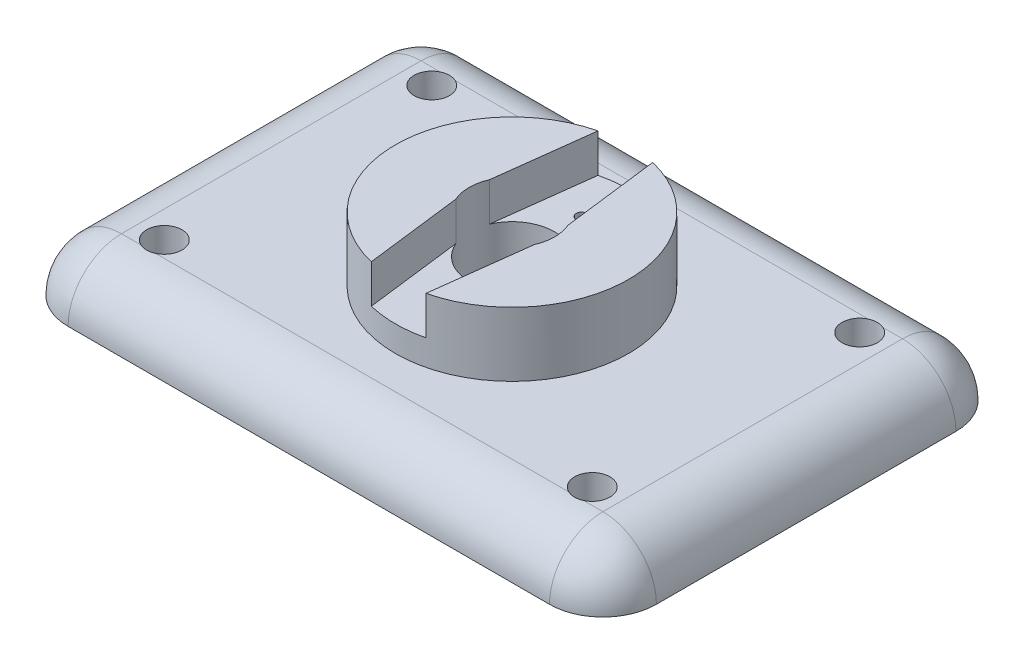
ISO-10303-21;
HEADER;
FILE_DESCRIPTION(('STEP AP214'),'2;1');
FILE_NAME('part.step','',(''),(''),'','','');
FILE_SCHEMA(('AUTOMOTIVE_DESIGN { 1 0 10303 214 1 1 1 1 }'));
ENDSEC;
DATA;
#1=APPLICATION_CONTEXT('core data for automotive mechanical design processes');
#2=APPLICATION_PROTOCOL_DEFINITION('international standard','automotive_design',2000,#1);
#3=PRODUCT_CONTEXT('',#1,'mechanical');
#4=PRODUCT('Part','Part','',(#3));
#5=PRODUCT_RELATED_PRODUCT_CATEGORY('part','',(#4));
#6=PRODUCT_DEFINITION_FORMATION('','',#4);
#7=PRODUCT_DEFINITION_CONTEXT('part definition',#1,'design');
#8=PRODUCT_DEFINITION('design','',#6,#7);
#9=PRODUCT_DEFINITION_SHAPE('','',#8);
#10=(LENGTH_UNIT() NAMED_UNIT(*) SI_UNIT(.MILLI.,.METRE.));
#11=(NAMED_UNIT(*) PLANE_ANGLE_UNIT() SI_UNIT($,.RADIAN.));
#12=(NAMED_UNIT(*) SI_UNIT($,.STERADIAN.) SOLID_ANGLE_UNIT());
#13=UNCERTAINTY_MEASURE_WITH_UNIT(LENGTH_MEASURE(1.E-05),#10,'distance_accuracy_value','');
#14=(GEOMETRIC_REPRESENTATION_CONTEXT(3) GLOBAL_UNCERTAINTY_ASSIGNED_CONTEXT((#13)) GLOBAL_UNIT_ASSIGNED_CONTEXT((#10,
#11,#12)) REPRESENTATION_CONTEXT('',''));
#15=CARTESIAN_POINT('',(0.,0.,0.));
#16=DIRECTION('',(0.,0.,1.));
#17=DIRECTION('',(1.,0.,0.));
#18=AXIS2_PLACEMENT_3D('',#15,#16,#17);
#19=CARTESIAN_POINT('',(22.5,0.,0.));
#20=DIRECTION('',(0.,0.,1.));
#21=DIRECTION('',(1.,0.,0.));
#22=AXIS2_PLACEMENT_3D('',#19,#20,#21);
#23=CYLINDRICAL_SURFACE('',#22,5.);
#24=CARTESIAN_POINT('',(22.5,0.,-14.));
#25=DIRECTION('',(0.,0.,-1.));
#26=DIRECTION('',(-1.,0.,0.));
#27=AXIS2_PLACEMENT_3D('',#24,#25,#26);
#28=CIRCLE('',#27,5.);
#29=CARTESIAN_POINT('',(22.5,5.,-14.));
#30=VERTEX_POINT('',#29);
#31=CARTESIAN_POINT('',(27.5,0.,-14.));
#32=VERTEX_POINT('',#31);
#33=EDGE_CURVE('E11',#30,#32,#28,.T.);
#34=ORIENTED_EDGE('',*,*,#33,.F.);
#35=DIRECTION('',(0.,0.,-1.));
#36=VECTOR('',#35,1.);
#37=CARTESIAN_POINT('',(22.5,5.,0.));
#38=LINE('',#37,#36);
#39=CARTESIAN_POINT('',(22.5,5.,14.));
#40=VERTEX_POINT('',#39);
#41=EDGE_CURVE('E200',#40,#30,#38,.T.);
#42=ORIENTED_EDGE('',*,*,#41,.F.);
#43=CARTESIAN_POINT('',(22.5,0.,14.));
#44=DIRECTION('',(0.,0.,-1.));
#45=DIRECTION('',(-1.,0.,0.));
#46=AXIS2_PLACEMENT_3D('',#43,#44,#45);
#47=CIRCLE('',#46,5.);
#48=CARTESIAN_POINT('',(27.5,0.,14.));
#49=VERTEX_POINT('',#48);
#50=EDGE_CURVE('E42',#40,#49,#47,.T.);
#51=ORIENTED_EDGE('',*,*,#50,.T.);
#52=DIRECTION('',(0.,0.,-1.));
#53=VECTOR('',#52,1.);
#54=CARTESIAN_POINT('',(27.5,0.,-19.));
#55=LINE('',#54,#53);
#56=EDGE_CURVE('E198',#49,#32,#55,.T.);
#57=ORIENTED_EDGE('',*,*,#56,.T.);
#58=EDGE_LOOP('',(#34,#42,#51,#57));
#59=FACE_BOUND('',#58,.T.);
#60=ADVANCED_FACE('F35',(#59),#23,.T.);
#61=CARTESIAN_POINT('',(22.5,0.,14.));
#62=DIRECTION('',(0.,1.,0.));
#63=DIRECTION('',(0.,0.,1.));
#64=AXIS2_PLACEMENT_3D('',#61,#62,#63);
#65=SPHERICAL_SURFACE('',#64,5.);
#66=ORIENTED_EDGE('',*,*,#50,.F.);
#67=CARTESIAN_POINT('',(22.5,0.,14.));
#68=DIRECTION('',(1.,0.,0.));
#69=DIRECTION('',(0.,0.,-1.));
#70=AXIS2_PLACEMENT_3D('',#67,#68,#69);
#71=CIRCLE('',#70,5.);
#72=CARTESIAN_POINT('',(22.5,0.,19.));
#73=VERTEX_POINT('',#72);
#74=EDGE_CURVE('E191',#40,#73,#71,.T.);
#75=ORIENTED_EDGE('',*,*,#74,.T.);
#76=CARTESIAN_POINT('',(22.5,0.,14.));
#77=DIRECTION('',(0.,1.,0.));
#78=DIRECTION('',(0.,0.,1.));
#79=AXIS2_PLACEMENT_3D('',#76,#77,#78);
#80=CIRCLE('',#79,5.);
#81=EDGE_CURVE('E204',#49,#73,#80,.F.);
#82=ORIENTED_EDGE('',*,*,#81,.F.);
#83=EDGE_LOOP('',(#66,#75,#82));
#84=FACE_BOUND('',#83,.T.);
#85=ADVANCED_FACE('F205',(#84),#65,.T.);
#86=CARTESIAN_POINT('',(0.,0.,14.));
#87=DIRECTION('',(-1.,0.,0.));
#88=DIRECTION('',(0.,0.,1.));
#89=AXIS2_PLACEMENT_3D('',#86,#87,#88);
#90=CYLINDRICAL_SURFACE('',#89,5.);
#91=CARTESIAN_POINT('',(20.,3.88297566307079,10.85));
#92=CARTESIAN_POINT('',(19.9199751011795,3.88298309060556,10.8500060633966));
#93=CARTESIAN_POINT('',(19.8398200370908,3.88776317371837,10.855873520602));
#94=CARTESIAN_POINT('',(19.6821334271219,3.90629756448855,10.878935570139));
#95=CARTESIAN_POINT('',(19.6046092804058,3.92007527924617,10.8961597077023));
#96=CARTESIAN_POINT('',(19.454952147166,3.95491487379321,10.9406811771444));
#97=CARTESIAN_POINT('',(19.3827835648531,3.97592219079964,10.9679031545414));
#98=CARTESIAN_POINT('',(19.2444459419637,4.02339018757288,11.0311801230705));
#99=CARTESIAN_POINT('',(19.1782767148258,4.04985069767849,11.0672348394025));
#100=CARTESIAN_POINT('',(19.045474164442,4.10967677149974,11.1515766646174));
#101=CARTESIAN_POINT('',(18.9796276803971,4.14348436779674,11.2007840552933));
#102=CARTESIAN_POINT('',(18.8566554051979,4.21365387247383,11.3075640581263));
#103=CARTESIAN_POINT('',(18.799535355176,4.2500174396602,11.3651421291733));
#104=CARTESIAN_POINT('',(18.6841711394043,4.33084864548329,11.499789243486));
#105=CARTESIAN_POINT('',(18.6279182444327,4.37550273072381,11.5784640643774));
#106=CARTESIAN_POINT('',(18.5297062489585,4.46359521834306,11.7449616057264));
#107=CARTESIAN_POINT('',(18.4877553086469,4.50703291376389,11.8327895114248));
#108=CARTESIAN_POINT('',(18.4179241331674,4.59263104592513,12.0203878192395));
#109=CARTESIAN_POINT('',(18.3908325035722,4.63462508473676,12.1205322377277));
#110=CARTESIAN_POINT('',(18.3558617782124,4.71283187196602,12.32629333793));
#111=CARTESIAN_POINT('',(18.3479680026502,4.74904901791749,12.4319057753239));
#112=CARTESIAN_POINT('',(18.3527074516447,4.81128928507107,12.6355142777017));
#113=CARTESIAN_POINT('',(18.3635921096058,4.83792967648545,12.7333608141201));
#114=CARTESIAN_POINT('',(18.4031593182867,4.88452809909448,12.9270206641908));
#115=CARTESIAN_POINT('',(18.431830713767,4.9044903065507,13.0228352133152));
#116=CARTESIAN_POINT('',(18.5030241666381,4.93630460321669,13.1998553301485));
#117=CARTESIAN_POINT('',(18.543986765768,4.94874359730387,13.2815867853052));
#118=CARTESIAN_POINT('',(18.6391811722809,4.96888760633564,13.4375575181165));
#119=CARTESIAN_POINT('',(18.6934113592043,4.97659319899913,13.5117977091668));
#120=CARTESIAN_POINT('',(18.8122188530584,4.98811366323374,13.6487863829849));
#121=CARTESIAN_POINT('',(18.8765282280403,4.99201429199949,13.7117606936671));
#122=CARTESIAN_POINT('',(19.0145835445762,4.99731825015039,13.8264651521855));
#123=CARTESIAN_POINT('',(19.0883302056354,4.99872138900345,13.8781944418811));
#124=CARTESIAN_POINT('',(19.2447313389366,5.00012397230557,13.9698433177125));
#125=CARTESIAN_POINT('',(19.3275282324075,5.00009628884195,14.0095203066798));
#126=CARTESIAN_POINT('',(19.4985485231845,4.99954974930594,14.0746172091254));
#127=CARTESIAN_POINT('',(19.5867722511117,4.99903086328008,14.1000362530051));
#128=CARTESIAN_POINT('',(19.7673870847415,4.9981795971668,14.1361484183822));
#129=CARTESIAN_POINT('',(19.8598175245552,4.99784973662133,14.1466452475393));
#130=CARTESIAN_POINT('',(20.0451300617896,4.9976902523867,14.1519855348725));
#131=CARTESIAN_POINT('',(20.1380121659231,4.9978606361552,14.1468287596845));
#132=CARTESIAN_POINT('',(20.3216434418073,4.99855205917507,14.1210018241566));
#133=CARTESIAN_POINT('',(20.4123914406698,4.99907328679219,14.1003233296212));
#134=CARTESIAN_POINT('',(20.5891353468217,4.9998847968298,14.0440278107509));
#135=CARTESIAN_POINT('',(20.6751310372066,5.00017506871713,14.0084101051978));
#136=CARTESIAN_POINT('',(20.8399488691497,4.99959129691439,13.9232332697394));
#137=CARTESIAN_POINT('',(20.918768905256,4.99871691266438,13.8736700653397));
#138=CARTESIAN_POINT('',(21.0669324482134,4.99464568331634,13.7620442847315));
#139=CARTESIAN_POINT('',(21.1362766774454,4.99144901537337,13.6999826622237));
#140=CARTESIAN_POINT('',(21.262856988924,4.98156712947765,13.5658854796643));
#141=CARTESIAN_POINT('',(21.3202014240413,4.97491520438696,13.4939498430884));
#142=CARTESIAN_POINT('',(21.4219571021269,4.95709844749199,13.3419604539981));
#143=CARTESIAN_POINT('',(21.4663711667037,4.94593460153096,13.2619084777438));
#144=CARTESIAN_POINT('',(21.5403686271542,4.91866401846536,13.0980618501944));
#145=CARTESIAN_POINT('',(21.5702411459395,4.90266486524413,13.0143796041361));
#146=CARTESIAN_POINT('',(21.6160499932203,4.8654102178732,12.8444269966818));
#147=CARTESIAN_POINT('',(21.6319861641419,4.84415466429449,12.7581566060339));
#148=CARTESIAN_POINT('',(21.6501368707898,4.79641098819217,12.5848724752555));
#149=CARTESIAN_POINT('',(21.652236884519,4.76988106205367,12.4978584856671));
#150=CARTESIAN_POINT('',(21.6430624278714,4.71234161305609,12.3260663979609));
#151=CARTESIAN_POINT('',(21.631784597678,4.6813309665918,12.2412888669921));
#152=CARTESIAN_POINT('',(21.5955443487752,4.61345922094686,12.0699560041001));
#153=CARTESIAN_POINT('',(21.5696735933996,4.57633984114759,11.9836963888342));
#154=CARTESIAN_POINT('',(21.5048705877471,4.49944553314451,11.817479982964));
#155=CARTESIAN_POINT('',(21.465929724106,4.45966886763825,11.737527391792));
#156=CARTESIAN_POINT('',(21.3713230294559,4.3748354862062,11.5772176868971));
#157=CARTESIAN_POINT('',(21.3143280900392,4.32966373712513,11.4977040149854));
#158=CARTESIAN_POINT('',(21.1867881244452,4.24057334828464,11.3495262144243));
#159=CARTESIAN_POINT('',(21.1162422235551,4.1966547896288,11.2808627866784));
#160=CARTESIAN_POINT('',(20.9726829386096,4.11870755301965,11.1644234482483));
#161=CARTESIAN_POINT('',(20.9012309500126,4.08413917639481,11.1150859340965));
#162=CARTESIAN_POINT('',(20.7494894999341,4.02080199160141,11.0274462975362));
#163=CARTESIAN_POINT('',(20.669209750247,3.99202690675677,10.9891322123903));
#164=CARTESIAN_POINT('',(20.5161952789082,3.94751186536308,10.9310838934496));
#165=CARTESIAN_POINT('',(20.444666750525,3.93036262220907,10.9092550726951));
#166=CARTESIAN_POINT('',(20.2980658315048,3.90351700882177,10.8754146981847));
#167=CARTESIAN_POINT('',(20.2230037915184,3.89380015312869,10.863376154216));
#168=CARTESIAN_POINT('',(20.1228230731576,3.88653607334843,10.8543933398595));
#169=CARTESIAN_POINT('',(20.0983116263551,3.88520382744971,10.8527482291179));
#170=CARTESIAN_POINT('',(20.0492042320319,3.88342240195428,10.8505505299904));
#171=CARTESIAN_POINT('',(20.0246082702928,3.88297337904686,10.849998135459));
#172=CARTESIAN_POINT('',(20.,3.88297566307079,10.85));
#173=B_SPLINE_CURVE_WITH_KNOTS('',3,(#91,#92,#93,#94,#95,#96,#97,#98,#99,#100,#101,#102,#103,
#104,#105,#106,#107,#108,#109,#110,#111,#112,#113,#114,#115,#116,#117,#118,#119,#120,#121,#122,
#123,#124,#125,#126,#127,#128,#129,#130,#131,#132,#133,#134,#135,#136,#137,#138,#139,#140,#141,
#142,#143,#144,#145,#146,#147,#148,#149,#150,#151,#152,#153,#154,#155,#156,#157,#158,#159,#160,
#161,#162,#163,#164,#165,#166,#167,#168,#169,#170,#171,#172),.UNSPECIFIED.,.T.,.F.,(4,2,2,2,2,2,
2,2,2,2,2,2,2,2,2,2,2,2,2,2,2,2,2,2,2,2,2,2,2,2,2,2,2,2,2,2,2,2,2,2,4),(0.,0.239963675020185,
0.48055410936638,0.719367211025591,0.95817288378904,1.22387060053709,1.48974237429046,
1.80794049529332,2.12631986626061,2.4602720979767,2.79396888996091,3.09824247081393,
3.40232541423324,3.67775890713376,3.95315877627129,4.22219742898757,4.49125660563031,
4.76541889208713,5.03959789801067,5.31735120074177,5.5951086442465,5.87301533296026,
6.15093469541208,6.4289353427896,6.7069147851593,6.98226414222926,7.25755336866179,
7.52711954116474,7.79668876152947,8.06848643563304,8.3403523855913,8.63137649649166,
8.92259277371149,9.24446555580365,9.56635912172981,9.84566370037572,10.1246640216089,
10.3539277565932,10.5825572852098,10.6563348687174,10.730125539651),.UNSPECIFIED.);
#174=CARTESIAN_POINT('',(19.3126136457566,5.,14.));
#175=VERTEX_POINT('',#174);
#176=CARTESIAN_POINT('',(20.6873863542434,5.,14.));
#177=VERTEX_POINT('',#176);
#178=EDGE_CURVE('E257',#175,#177,#173,.T.);
#179=ORIENTED_EDGE('',*,*,#178,.F.);
#180=DIRECTION('',(1.,0.,0.));
#181=VECTOR('',#180,1.);
#182=CARTESIAN_POINT('',(0.,5.,14.));
#183=LINE('',#182,#181);
#184=CARTESIAN_POINT('',(-19.3126136457566,5.,14.));
#185=VERTEX_POINT('',#184);
#186=EDGE_CURVE('E246',#185,#175,#183,.T.);
#187=ORIENTED_EDGE('',*,*,#186,.F.);
#188=CARTESIAN_POINT('',(-20.,3.88297566307079,10.85));
#189=CARTESIAN_POINT('',(-20.0800248988205,3.88298309060556,10.8500060633966));
#190=CARTESIAN_POINT('',(-20.1601799629093,3.88776317371837,10.855873520602));
#191=CARTESIAN_POINT('',(-20.3178665728781,3.90629756448855,10.878935570139));
#192=CARTESIAN_POINT('',(-20.3953907195942,3.92007527924617,10.8961597077023));
#193=CARTESIAN_POINT('',(-20.545047852834,3.95491487379321,10.9406811771444));
#194=CARTESIAN_POINT('',(-20.6172164351469,3.97592219079964,10.9679031545414));
#195=CARTESIAN_POINT('',(-20.7555540580363,4.02339018757288,11.0311801230705));
#196=CARTESIAN_POINT('',(-20.8217232851742,4.04985069767849,11.0672348394025));
#197=CARTESIAN_POINT('',(-20.954525835558,4.10967677149974,11.1515766646174));
#198=CARTESIAN_POINT('',(-21.0203723196029,4.14348436779674,11.2007840552933));
#199=CARTESIAN_POINT('',(-21.1433445948021,4.21365387247383,11.3075640581263));
#200=CARTESIAN_POINT('',(-21.200464644824,4.2500174396602,11.3651421291733));
#201=CARTESIAN_POINT('',(-21.3158288605957,4.33084864548329,11.499789243486));
#202=CARTESIAN_POINT('',(-21.3720817555673,4.37550273072381,11.5784640643774));
#203=CARTESIAN_POINT('',(-21.4702937510415,4.46359521834306,11.7449616057264));
#204=CARTESIAN_POINT('',(-21.5122446913531,4.50703291376389,11.8327895114248));
#205=CARTESIAN_POINT('',(-21.5820758668326,4.59263104592513,12.0203878192395));
#206=CARTESIAN_POINT('',(-21.6091674964278,4.63462508473676,12.1205322377277));
#207=CARTESIAN_POINT('',(-21.6441382217876,4.71283187196602,12.32629333793));
#208=CARTESIAN_POINT('',(-21.6520319973498,4.74904901791749,12.4319057753239));
#209=CARTESIAN_POINT('',(-21.6472925483553,4.81128928507107,12.6355142777017));
#210=CARTESIAN_POINT('',(-21.6364078903942,4.83792967648545,12.7333608141201));
#211=CARTESIAN_POINT('',(-21.5968406817133,4.88452809909448,12.9270206641908));
#212=CARTESIAN_POINT('',(-21.568169286233,4.9044903065507,13.0228352133152));
#213=CARTESIAN_POINT('',(-21.4969758333619,4.93630460321669,13.1998553301485));
#214=CARTESIAN_POINT('',(-21.456013234232,4.94874359730387,13.2815867853052));
#215=CARTESIAN_POINT('',(-21.3608188277191,4.96888760633564,13.4375575181165));
#216=CARTESIAN_POINT('',(-21.3065886407957,4.97659319899913,13.5117977091668));
#217=CARTESIAN_POINT('',(-21.1877811469416,4.98811366323374,13.6487863829849));
#218=CARTESIAN_POINT('',(-21.1234717719597,4.99201429199949,13.7117606936671));
#219=CARTESIAN_POINT('',(-20.9854164554238,4.99731825015039,13.8264651521855));
#220=CARTESIAN_POINT('',(-20.9116697943646,4.99872138900345,13.8781944418811));
#221=CARTESIAN_POINT('',(-20.7552686610634,5.00012397230557,13.9698433177125));
#222=CARTESIAN_POINT('',(-20.6724717675925,5.00009628884195,14.0095203066798));
#223=CARTESIAN_POINT('',(-20.5014514768155,4.99954974930594,14.0746172091254));
#224=CARTESIAN_POINT('',(-20.4132277488883,4.99903086328008,14.1000362530051));
#225=CARTESIAN_POINT('',(-20.2326129152585,4.9981795971668,14.1361484183822));
#226=CARTESIAN_POINT('',(-20.1401824754448,4.99784973662133,14.1466452475393));
#227=CARTESIAN_POINT('',(-19.9548699382104,4.9976902523867,14.1519855348725));
#228=CARTESIAN_POINT('',(-19.8619878340769,4.9978606361552,14.1468287596845));
#229=CARTESIAN_POINT('',(-19.6783565581927,4.99855205917507,14.1210018241566));
#230=CARTESIAN_POINT('',(-19.5876085593302,4.99907328679219,14.1003233296212));
#231=CARTESIAN_POINT('',(-19.4108646531783,4.9998847968298,14.0440278107509));
#232=CARTESIAN_POINT('',(-19.3248689627934,5.00017506871713,14.0084101051978));
#233=CARTESIAN_POINT('',(-19.1600511308503,4.99959129691439,13.9232332697394));
#234=CARTESIAN_POINT('',(-19.081231094744,4.99871691266438,13.8736700653397));
#235=CARTESIAN_POINT('',(-18.9330675517866,4.99464568331634,13.7620442847315));
#236=CARTESIAN_POINT('',(-18.8637233225546,4.99144901537337,13.6999826622237));
#237=CARTESIAN_POINT('',(-18.737143011076,4.98156712947765,13.5658854796643));
#238=CARTESIAN_POINT('',(-18.6797985759587,4.97491520438696,13.4939498430884));
#239=CARTESIAN_POINT('',(-18.5780428978731,4.95709844749199,13.3419604539981));
#240=CARTESIAN_POINT('',(-18.5336288332963,4.94593460153096,13.2619084777438));
#241=CARTESIAN_POINT('',(-18.4596313728458,4.91866401846536,13.0980618501944));
#242=CARTESIAN_POINT('',(-18.4297588540605,4.90266486524413,13.0143796041361));
#243=CARTESIAN_POINT('',(-18.3839500067797,4.86541021787321,12.8444269966818));
#244=CARTESIAN_POINT('',(-18.3680138358581,4.84415466429449,12.7581566060339));
#245=CARTESIAN_POINT('',(-18.3498631292102,4.79641098819217,12.5848724752555));
#246=CARTESIAN_POINT('',(-18.347763115481,4.76988106205367,12.4978584856671));
#247=CARTESIAN_POINT('',(-18.3569375721286,4.71234161305609,12.3260663979609));
#248=CARTESIAN_POINT('',(-18.368215402322,4.6813309665918,12.2412888669921));
#249=CARTESIAN_POINT('',(-18.4044556512248,4.61345922094686,12.0699560041001));
#250=CARTESIAN_POINT('',(-18.4303264066004,4.57633984114759,11.9836963888342));
#251=CARTESIAN_POINT('',(-18.4951294122529,4.49944553314451,11.817479982964));
#252=CARTESIAN_POINT('',(-18.534070275894,4.45966886763825,11.737527391792));
#253=CARTESIAN_POINT('',(-18.6286769705441,4.3748354862062,11.5772176868971));
#254=CARTESIAN_POINT('',(-18.6856719099608,4.32966373712513,11.4977040149854));
#255=CARTESIAN_POINT('',(-18.8132118755548,4.24057334828464,11.3495262144243));
#256=CARTESIAN_POINT('',(-18.8837577764449,4.1966547896288,11.2808627866784));
#257=CARTESIAN_POINT('',(-19.0273170613904,4.11870755301965,11.1644234482483));
#258=CARTESIAN_POINT('',(-19.0987690499874,4.08413917639481,11.1150859340965));
#259=CARTESIAN_POINT('',(-19.2505105000659,4.02080199160141,11.0274462975362));
#260=CARTESIAN_POINT('',(-19.330790249753,3.99202690675677,10.9891322123903));
#261=CARTESIAN_POINT('',(-19.4838047210918,3.94751186536308,10.9310838934496));
#262=CARTESIAN_POINT('',(-19.555333249475,3.93036262220907,10.9092550726951));
#263=CARTESIAN_POINT('',(-19.7019341684952,3.90351700882177,10.8754146981847));
#264=CARTESIAN_POINT('',(-19.7769962084816,3.89380015312869,10.863376154216));
#265=CARTESIAN_POINT('',(-19.8771769268424,3.88653607334843,10.8543933398595));
#266=CARTESIAN_POINT('',(-19.9016883736449,3.88520382744971,10.8527482291179));
#267=CARTESIAN_POINT('',(-19.9507957679681,3.88342240195428,10.8505505299904));
#268=CARTESIAN_POINT('',(-19.9753917297072,3.88297337904686,10.849998135459));
#269=CARTESIAN_POINT('',(-20.,3.88297566307079,10.85));
#270=B_SPLINE_CURVE_WITH_KNOTS('',3,(#188,#189,#190,#191,#192,#193,#194,#195,#196,#197,#198,
#199,#200,#201,#202,#203,#204,#205,#206,#207,#208,#209,#210,#211,#212,#213,#214,#215,#216,#217,
#218,#219,#220,#221,#222,#223,#224,#225,#226,#227,#228,#229,#230,#231,#232,#233,#234,#235,#236,
#237,#238,#239,#240,#241,#242,#243,#244,#245,#246,#247,#248,#249,#250,#251,#252,#253,#254,#255,
#256,#257,#258,#259,#260,#261,#262,#263,#264,#265,#266,#267,#268,#269),.UNSPECIFIED.,.T.,.F.,(4,
2,2,2,2,2,2,2,2,2,2,2,2,2,2,2,2,2,2,2,2,2,2,2,2,2,2,2,2,2,2,2,2,2,2,2,2,2,2,2,4),(0.,
0.239963675020185,0.48055410936638,0.719367211025591,0.95817288378904,1.22387060053709,
1.48974237429046,1.80794049529332,2.12631986626061,2.4602720979767,2.79396888996091,
3.09824247081393,3.40232541423324,3.67775890713376,3.95315877627129,4.22219742898757,
4.49125660563031,4.76541889208713,5.03959789801067,5.31735120074177,5.5951086442465,
5.87301533296026,6.15093469541208,6.4289353427896,6.7069147851593,6.98226414222926,
7.25755336866179,7.52711954116474,7.79668876152947,8.06848643563304,8.3403523855913,
8.63137649649166,8.92259277371149,9.24446555580365,9.56635912172981,9.84566370037572,
10.1246640216089,10.3539277565932,10.5825572852098,10.6563348687174,10.730125539651),.UNSPECIFIED.);
#271=CARTESIAN_POINT('',(-20.6873863542434,5.,14.));
#272=VERTEX_POINT('',#271);
#273=EDGE_CURVE('E299',#272,#185,#270,.T.);
#274=ORIENTED_EDGE('',*,*,#273,.F.);
#275=CARTESIAN_POINT('',(-22.5,5.,14.));
#276=VERTEX_POINT('',#275);
#277=EDGE_CURVE('E244',#276,#272,#183,.T.);
#278=ORIENTED_EDGE('',*,*,#277,.F.);
#279=CARTESIAN_POINT('',(-22.5,0.,14.));
#280=DIRECTION('',(1.,0.,0.));
#281=DIRECTION('',(0.,0.,-1.));
#282=AXIS2_PLACEMENT_3D('',#279,#280,#281);
#283=CIRCLE('',#282,5.);
#284=CARTESIAN_POINT('',(-22.5,0.,19.));
#285=VERTEX_POINT('',#284);
#286=EDGE_CURVE('E189',#276,#285,#283,.T.);
#287=ORIENTED_EDGE('',*,*,#286,.T.);
#288=DIRECTION('',(1.,0.,0.));
#289=VECTOR('',#288,1.);
#290=CARTESIAN_POINT('',(-27.5,0.,19.));
#291=LINE('',#290,#289);
#292=EDGE_CURVE('E231',#285,#73,#291,.T.);
#293=ORIENTED_EDGE('',*,*,#292,.T.);
#294=ORIENTED_EDGE('',*,*,#74,.F.);
#295=EDGE_CURVE('E243',#177,#40,#183,.T.);
#296=ORIENTED_EDGE('',*,*,#295,.F.);
#297=EDGE_LOOP('',(#179,#187,#274,#278,#287,#293,#294,#296));
#298=FACE_BOUND('',#297,.T.);
#299=ADVANCED_FACE('F255',(#298),#90,.T.);
#300=CARTESIAN_POINT('',(-22.5,0.,14.));
#301=DIRECTION('',(0.,1.,0.));
#302=DIRECTION('',(0.,0.,1.));
#303=AXIS2_PLACEMENT_3D('',#300,#301,#302);
#304=SPHERICAL_SURFACE('',#303,5.);
#305=ORIENTED_EDGE('',*,*,#286,.F.);
#306=CARTESIAN_POINT('',(-22.5,0.,14.));
#307=DIRECTION('',(0.,0.,1.));
#308=DIRECTION('',(1.,0.,0.));
#309=AXIS2_PLACEMENT_3D('',#306,#307,#308);
#310=CIRCLE('',#309,5.);
#311=CARTESIAN_POINT('',(-27.5,0.,14.));
#312=VERTEX_POINT('',#311);
#313=EDGE_CURVE('E187',#276,#312,#310,.T.);
#314=ORIENTED_EDGE('',*,*,#313,.T.);
#315=CARTESIAN_POINT('',(-22.5,0.,14.));
#316=DIRECTION('',(0.,1.,0.));
#317=DIRECTION('',(0.,0.,1.));
#318=AXIS2_PLACEMENT_3D('',#315,#316,#317);
#319=CIRCLE('',#318,5.);
#320=EDGE_CURVE('E209',#285,#312,#319,.F.);
#321=ORIENTED_EDGE('',*,*,#320,.F.);
#322=EDGE_LOOP('',(#305,#314,#321));
#323=FACE_BOUND('',#322,.T.);
#324=ADVANCED_FACE('F261',(#323),#304,.T.);
#325=CARTESIAN_POINT('',(-22.5,0.,0.));
#326=DIRECTION('',(0.,0.,-1.));
#327=DIRECTION('',(-1.,0.,0.));
#328=AXIS2_PLACEMENT_3D('',#325,#326,#327);
#329=CYLINDRICAL_SURFACE('',#328,5.);
#330=ORIENTED_EDGE('',*,*,#313,.F.);
#331=DIRECTION('',(0.,0.,1.));
#332=VECTOR('',#331,1.);
#333=CARTESIAN_POINT('',(-22.5,5.,0.));
#334=LINE('',#333,#332);
#335=CARTESIAN_POINT('',(-22.5,5.,-14.));
#336=VERTEX_POINT('',#335);
#337=EDGE_CURVE('E178',#336,#276,#334,.T.);
#338=ORIENTED_EDGE('',*,*,#337,.F.);
#339=CARTESIAN_POINT('',(-22.5,0.,-14.));
#340=DIRECTION('',(0.,0.,1.));
#341=DIRECTION('',(1.,0.,0.));
#342=AXIS2_PLACEMENT_3D('',#339,#340,#341);
#343=CIRCLE('',#342,5.);
#344=CARTESIAN_POINT('',(-27.5,0.,-14.));
#345=VERTEX_POINT('',#344);
#346=EDGE_CURVE('E185',#336,#345,#343,.T.);
#347=ORIENTED_EDGE('',*,*,#346,.T.);
#348=DIRECTION('',(0.,0.,1.));
#349=VECTOR('',#348,1.);
#350=CARTESIAN_POINT('',(-27.5,0.,-19.));
#351=LINE('',#350,#349);
#352=EDGE_CURVE('E221',#345,#312,#351,.T.);
#353=ORIENTED_EDGE('',*,*,#352,.T.);
#354=EDGE_LOOP('',(#330,#338,#347,#353));
#355=FACE_BOUND('',#354,.T.);
#356=ADVANCED_FACE('F265',(#355),#329,.T.);
#357=CARTESIAN_POINT('',(-22.5,0.,-14.));
#358=DIRECTION('',(0.,1.,0.));
#359=DIRECTION('',(0.,0.,1.));
#360=AXIS2_PLACEMENT_3D('',#357,#358,#359);
#361=SPHERICAL_SURFACE('',#360,5.);
#362=ORIENTED_EDGE('',*,*,#346,.F.);
#363=CARTESIAN_POINT('',(-22.5,0.,-14.));
#364=DIRECTION('',(-1.,0.,0.));
#365=DIRECTION('',(0.,0.,1.));
#366=AXIS2_PLACEMENT_3D('',#363,#364,#365);
#367=CIRCLE('',#366,5.);
#368=CARTESIAN_POINT('',(-22.5,0.,-19.));
#369=VERTEX_POINT('',#368);
#370=EDGE_CURVE('E183',#336,#369,#367,.T.);
#371=ORIENTED_EDGE('',*,*,#370,.T.);
#372=CARTESIAN_POINT('',(-22.5,0.,-14.));
#373=DIRECTION('',(0.,1.,0.));
#374=DIRECTION('',(0.,0.,1.));
#375=AXIS2_PLACEMENT_3D('',#372,#373,#374);
#376=CIRCLE('',#375,5.);
#377=EDGE_CURVE('E239',#345,#369,#376,.F.);
#378=ORIENTED_EDGE('',*,*,#377,.F.);
#379=EDGE_LOOP('',(#362,#371,#378));
#380=FACE_BOUND('',#379,.T.);
#381=ADVANCED_FACE('F269',(#380),#361,.T.);
#382=CARTESIAN_POINT('',(0.,0.,-14.));
#383=DIRECTION('',(1.,0.,0.));
#384=DIRECTION('',(0.,0.,-1.));
#385=AXIS2_PLACEMENT_3D('',#382,#383,#384);
#386=CYLINDRICAL_SURFACE('',#385,5.);
#387=CARTESIAN_POINT('',(20.6873863542434,5.,-14.));
#388=CARTESIAN_POINT('',(20.6452006263695,4.99999753990819,-14.0193313173724));
#389=CARTESIAN_POINT('',(20.6022201385381,4.99988830242698,-14.0368732750959));
#390=CARTESIAN_POINT('',(20.5149368662713,4.9995588501114,-14.0682773213281));
#391=CARTESIAN_POINT('',(20.4706341154973,4.99933863809989,-14.0821395034258));
#392=CARTESIAN_POINT('',(20.3362364941667,4.9986658693959,-14.1180302411279));
#393=CARTESIAN_POINT('',(20.2445603030311,4.99820073315848,-14.1344050229614));
#394=CARTESIAN_POINT('',(20.0597487691461,4.99771037122391,-14.1515341148122));
#395=CARTESIAN_POINT('',(19.9666124071847,4.9976854678687,-14.1522769790938));
#396=CARTESIAN_POINT('',(19.7816025978799,4.99809759865887,-14.1381036021411));
#397=CARTESIAN_POINT('',(19.6897277148633,4.99853405427521,-14.1232069724792));
#398=CARTESIAN_POINT('',(19.5505011423755,4.99923255383236,-14.0884096632062));
#399=CARTESIAN_POINT('',(19.5017668405864,4.99948442530036,-14.0738005606167));
#400=CARTESIAN_POINT('',(19.4059089985854,4.9998660621726,-14.0401724538694));
#401=CARTESIAN_POINT('',(19.3587836086439,4.99999597268376,-14.0211587239396));
#402=CARTESIAN_POINT('',(19.3126136457566,5.,-14.));
#403=B_SPLINE_CURVE_WITH_KNOTS('',3,(#387,#388,#389,#390,#391,#392,#393,#394,#395,#396,#397,
#398,#399,#400,#401,#402),.UNSPECIFIED.,.F.,.F.,(4,2,2,2,2,2,2,4),(0.,0.139125357405747,
0.278247176056335,0.556191350275149,0.834339028952306,1.11213833284477,1.26457844225894,
1.41683695048851),.UNSPECIFIED.);
#404=CARTESIAN_POINT('',(20.6873863542434,5.,-14.));
#405=VERTEX_POINT('',#404);
#406=CARTESIAN_POINT('',(19.3126136457566,5.,-14.));
#407=VERTEX_POINT('',#406);
#408=EDGE_CURVE('E55',#405,#407,#403,.T.);
#409=ORIENTED_EDGE('',*,*,#408,.F.);
#410=DIRECTION('',(-1.,0.,0.));
#411=VECTOR('',#410,1.);
#412=CARTESIAN_POINT('',(0.,5.,-14.));
#413=LINE('',#412,#411);
#414=EDGE_CURVE('E175',#30,#405,#413,.T.);
#415=ORIENTED_EDGE('',*,*,#414,.F.);
#416=CARTESIAN_POINT('',(22.5,0.,-14.));
#417=DIRECTION('',(-1.,0.,0.));
#418=DIRECTION('',(0.,0.,1.));
#419=AXIS2_PLACEMENT_3D('',#416,#417,#418);
#420=CIRCLE('',#419,5.);
#421=CARTESIAN_POINT('',(22.5,0.,-19.));
#422=VERTEX_POINT('',#421);
#423=EDGE_CURVE('E177',#30,#422,#420,.T.);
#424=ORIENTED_EDGE('',*,*,#423,.T.);
#425=DIRECTION('',(-1.,0.,0.));
#426=VECTOR('',#425,1.);
#427=CARTESIAN_POINT('',(-27.5,0.,-19.));
#428=LINE('',#427,#426);
#429=EDGE_CURVE('E217',#422,#369,#428,.T.);
#430=ORIENTED_EDGE('',*,*,#429,.T.);
#431=ORIENTED_EDGE('',*,*,#370,.F.);
#432=CARTESIAN_POINT('',(-20.6873863542434,5.,-14.));
#433=VERTEX_POINT('',#432);
#434=EDGE_CURVE('E168',#433,#336,#413,.T.);
#435=ORIENTED_EDGE('',*,*,#434,.F.);
#436=CARTESIAN_POINT('',(-19.3126136457566,5.,-14.));
#437=CARTESIAN_POINT('',(-19.3547993736305,4.99999753990819,-14.0193313173724));
#438=CARTESIAN_POINT('',(-19.3977798614619,4.99988830242698,-14.0368732750959));
#439=CARTESIAN_POINT('',(-19.4850631337287,4.9995588501114,-14.0682773213281));
#440=CARTESIAN_POINT('',(-19.5293658845027,4.99933863809989,-14.0821395034258));
#441=CARTESIAN_POINT('',(-19.6637635058333,4.9986658693959,-14.1180302411279));
#442=CARTESIAN_POINT('',(-19.7554396969689,4.99820073315848,-14.1344050229614));
#443=CARTESIAN_POINT('',(-19.9402512308539,4.99771037122391,-14.1515341148122));
#444=CARTESIAN_POINT('',(-20.0333875928153,4.9976854678687,-14.1522769790938));
#445=CARTESIAN_POINT('',(-20.2183974021201,4.99809759865887,-14.1381036021411));
#446=CARTESIAN_POINT('',(-20.3102722851367,4.99853405427521,-14.1232069724792));
#447=CARTESIAN_POINT('',(-20.4494988576245,4.99923255383236,-14.0884096632062));
#448=CARTESIAN_POINT('',(-20.4982331594136,4.99948442530036,-14.0738005606167));
#449=CARTESIAN_POINT('',(-20.5940910014146,4.9998660621726,-14.0401724538694));
#450=CARTESIAN_POINT('',(-20.6412163913561,4.99999597268376,-14.0211587239396));
#451=CARTESIAN_POINT('',(-20.6873863542434,5.,-14.));
#452=B_SPLINE_CURVE_WITH_KNOTS('',3,(#436,#437,#438,#439,#440,#441,#442,#443,#444,#445,#446,
#447,#448,#449,#450,#451),.UNSPECIFIED.,.F.,.F.,(4,2,2,2,2,2,2,4),(0.,0.139125357405747,
0.278247176056335,0.556191350275149,0.834339028952309,1.11213833284477,1.26457844225894,
1.41683695048851),.UNSPECIFIED.);
#453=CARTESIAN_POINT('',(-19.3126136457566,5.,-14.));
#454=VERTEX_POINT('',#453);
#455=EDGE_CURVE('E48',#454,#433,#452,.T.);
#456=ORIENTED_EDGE('',*,*,#455,.F.);
#457=EDGE_CURVE('E166',#407,#454,#413,.T.);
#458=ORIENTED_EDGE('',*,*,#457,.F.);
#459=EDGE_LOOP('',(#409,#415,#424,#430,#431,#435,#456,#458));
#460=FACE_BOUND('',#459,.T.);
#461=ADVANCED_FACE('F165',(#460),#386,.T.);
#462=CARTESIAN_POINT('',(22.5,0.,-14.));
#463=DIRECTION('',(0.,1.,0.));
#464=DIRECTION('',(0.,0.,1.));
#465=AXIS2_PLACEMENT_3D('',#462,#463,#464);
#466=SPHERICAL_SURFACE('',#465,5.);
#467=ORIENTED_EDGE('',*,*,#423,.F.);
#468=ORIENTED_EDGE('',*,*,#33,.T.);
#469=CARTESIAN_POINT('',(22.5,0.,-14.));
#470=DIRECTION('',(0.,1.,0.));
#471=DIRECTION('',(0.,0.,1.));
#472=AXIS2_PLACEMENT_3D('',#469,#470,#471);
#473=CIRCLE('',#472,5.);
#474=EDGE_CURVE('E216',#422,#32,#473,.F.);
#475=ORIENTED_EDGE('',*,*,#474,.F.);
#476=EDGE_LOOP('',(#467,#468,#475));
#477=FACE_BOUND('',#476,.T.);
#478=ADVANCED_FACE('F273',(#477),#466,.T.);
#479=CARTESIAN_POINT('',(0.,11.,0.));
#480=DIRECTION('',(0.,1.,0.));
#481=DIRECTION('',(0.,0.,1.));
#482=AXIS2_PLACEMENT_3D('',#479,#480,#481);
#483=PLANE('',#482);
#484=DIRECTION('',(-0.123207360520907,0.,0.992380948181429));
#485=VECTOR('',#484,1.);
#486=CARTESIAN_POINT('',(-3.67480993884706,11.,-1.57980122589865));
#487=LINE('',#486,#485);
#488=CARTESIAN_POINT('',(-2.55539130799865,11.,-10.5962245759046));
#489=VERTEX_POINT('',#488);
#490=CARTESIAN_POINT('',(-3.67480993884706,11.,-1.57980122589865));
#491=VERTEX_POINT('',#490);
#492=EDGE_CURVE('E404',#489,#491,#487,.T.);
#493=ORIENTED_EDGE('',*,*,#492,.F.);
#494=CARTESIAN_POINT('',(0.,11.,0.));
#495=DIRECTION('',(0.,1.,0.));
#496=DIRECTION('',(0.,0.,1.));
#497=AXIS2_PLACEMENT_3D('',#494,#495,#496);
#498=CIRCLE('',#497,10.9);
#499=CARTESIAN_POINT('',(-2.55539130799865,11.,10.5962245759046));
#500=VERTEX_POINT('',#499);
#501=EDGE_CURVE('E224',#489,#500,#498,.T.);
#502=ORIENTED_EDGE('',*,*,#501,.T.);
#503=DIRECTION('',(0.123207360520907,0.,0.992380948181429));
#504=VECTOR('',#503,1.);
#505=CARTESIAN_POINT('',(-3.67480993884706,11.,1.57980122589865));
#506=LINE('',#505,#504);
#507=CARTESIAN_POINT('',(-3.67480993884706,11.,1.57980122589865));
#508=VERTEX_POINT('',#507);
#509=EDGE_CURVE('E382',#508,#500,#506,.T.);
#510=ORIENTED_EDGE('',*,*,#509,.F.);
#511=CARTESIAN_POINT('',(0.,11.,0.));
#512=DIRECTION('',(0.,-1.,0.));
#513=DIRECTION('',(0.,0.,-1.));
#514=AXIS2_PLACEMENT_3D('',#511,#512,#513);
#515=CIRCLE('',#514,4.);
#516=EDGE_CURVE('E361',#508,#491,#515,.T.);
#517=ORIENTED_EDGE('',*,*,#516,.T.);
#518=EDGE_LOOP('',(#493,#502,#510,#517));
#519=FACE_BOUND('',#518,.T.);
#520=ADVANCED_FACE('F275',(#519),#483,.T.);
#521=CARTESIAN_POINT('',(0.,5.,0.));
#522=DIRECTION('',(0.,1.,0.));
#523=DIRECTION('',(0.,0.,1.));
#524=AXIS2_PLACEMENT_3D('',#521,#522,#523);
#525=PLANE('',#524);
#526=CARTESIAN_POINT('',(20.,5.,12.5));
#527=DIRECTION('',(0.,1.,0.));
#528=DIRECTION('',(0.,0.,1.));
#529=AXIS2_PLACEMENT_3D('',#526,#527,#528);
#530=CIRCLE('',#529,1.65);
#531=EDGE_CURVE('E252',#177,#175,#530,.T.);
#532=ORIENTED_EDGE('',*,*,#531,.F.);
#533=ORIENTED_EDGE('',*,*,#295,.T.);
#534=ORIENTED_EDGE('',*,*,#41,.T.);
#535=ORIENTED_EDGE('',*,*,#414,.T.);
#536=CARTESIAN_POINT('',(20.,5.,-12.5));
#537=DIRECTION('',(0.,1.,0.));
#538=DIRECTION('',(0.,0.,1.));
#539=AXIS2_PLACEMENT_3D('',#536,#537,#538);
#540=CIRCLE('',#539,1.65);
#541=EDGE_CURVE('E169',#407,#405,#540,.T.);
#542=ORIENTED_EDGE('',*,*,#541,.F.);
#543=ORIENTED_EDGE('',*,*,#457,.T.);
#544=CARTESIAN_POINT('',(-20.,5.,-12.5));
#545=DIRECTION('',(0.,1.,0.));
#546=DIRECTION('',(0.,0.,1.));
#547=AXIS2_PLACEMENT_3D('',#544,#545,#546);
#548=CIRCLE('',#547,1.65);
#549=EDGE_CURVE('E155',#433,#454,#548,.T.);
#550=ORIENTED_EDGE('',*,*,#549,.F.);
#551=ORIENTED_EDGE('',*,*,#434,.T.);
#552=ORIENTED_EDGE('',*,*,#337,.T.);
#553=ORIENTED_EDGE('',*,*,#277,.T.);
#554=CARTESIAN_POINT('',(-20.,5.,12.5));
#555=DIRECTION('',(0.,1.,0.));
#556=DIRECTION('',(0.,0.,1.));
#557=AXIS2_PLACEMENT_3D('',#554,#555,#556);
#558=CIRCLE('',#557,1.65);
#559=EDGE_CURVE('E657',#185,#272,#558,.T.);
#560=ORIENTED_EDGE('',*,*,#559,.F.);
#561=ORIENTED_EDGE('',*,*,#186,.T.);
#562=EDGE_LOOP('',(#532,#533,#534,#535,#542,#543,#550,#551,#552,#553,#560,#561));
#563=FACE_BOUND('',#562,.T.);
#564=CARTESIAN_POINT('',(0.,5.,0.));
#565=DIRECTION('',(0.,1.,0.));
#566=DIRECTION('',(0.,0.,1.));
#567=AXIS2_PLACEMENT_3D('',#564,#565,#566);
#568=CIRCLE('',#567,10.9);
#569=CARTESIAN_POINT('',(0.,5.,10.9));
#570=VERTEX_POINT('',#569);
#571=EDGE_CURVE('E227',#570,#570,#568,.T.);
#572=ORIENTED_EDGE('',*,*,#571,.F.);
#573=EDGE_LOOP('',(#572));
#574=FACE_BOUND('',#573,.T.);
#575=ADVANCED_FACE('F172',(#563,#574),#525,.T.);
#576=CARTESIAN_POINT('',(0.,0.,0.));
#577=DIRECTION('',(0.,1.,0.));
#578=DIRECTION('',(0.,0.,1.));
#579=AXIS2_PLACEMENT_3D('',#576,#577,#578);
#580=PLANE('',#579);
#581=CARTESIAN_POINT('',(20.,0.,12.5));
#582=DIRECTION('',(0.,-1.,0.));
#583=DIRECTION('',(0.,0.,-1.));
#584=AXIS2_PLACEMENT_3D('',#581,#582,#583);
#585=CIRCLE('',#584,1.65);
#586=CARTESIAN_POINT('',(20.,0.,10.85));
#587=VERTEX_POINT('',#586);
#588=EDGE_CURVE('E161',#587,#587,#585,.T.);
#589=ORIENTED_EDGE('',*,*,#588,.F.);
#590=EDGE_LOOP('',(#589));
#591=FACE_BOUND('',#590,.T.);
#592=CARTESIAN_POINT('',(20.,0.,-12.5));
#593=DIRECTION('',(0.,-1.,0.));
#594=DIRECTION('',(0.,0.,-1.));
#595=AXIS2_PLACEMENT_3D('',#592,#593,#594);
#596=CIRCLE('',#595,1.65);
#597=CARTESIAN_POINT('',(20.,0.,-14.15));
#598=VERTEX_POINT('',#597);
#599=EDGE_CURVE('E337',#598,#598,#596,.T.);
#600=ORIENTED_EDGE('',*,*,#599,.F.);
#601=EDGE_LOOP('',(#600));
#602=FACE_BOUND('',#601,.T.);
#603=CARTESIAN_POINT('',(-20.,0.,-12.5));
#604=DIRECTION('',(0.,-1.,0.));
#605=DIRECTION('',(0.,0.,-1.));
#606=AXIS2_PLACEMENT_3D('',#603,#604,#605);
#607=CIRCLE('',#606,1.65);
#608=CARTESIAN_POINT('',(-20.,0.,-14.15));
#609=VERTEX_POINT('',#608);
#610=EDGE_CURVE('E334',#609,#609,#607,.T.);
#611=ORIENTED_EDGE('',*,*,#610,.F.);
#612=EDGE_LOOP('',(#611));
#613=FACE_BOUND('',#612,.T.);
#614=CARTESIAN_POINT('',(-20.,0.,12.5));
#615=DIRECTION('',(0.,-1.,0.));
#616=DIRECTION('',(0.,0.,-1.));
#617=AXIS2_PLACEMENT_3D('',#614,#615,#616);
#618=CIRCLE('',#617,1.65);
#619=CARTESIAN_POINT('',(-20.,0.,10.85));
#620=VERTEX_POINT('',#619);
#621=EDGE_CURVE('E311',#620,#620,#618,.T.);
#622=ORIENTED_EDGE('',*,*,#621,.F.);
#623=EDGE_LOOP('',(#622));
#624=FACE_BOUND('',#623,.T.);
#625=CARTESIAN_POINT('',(0.,0.,0.));
#626=DIRECTION('',(0.,-1.,0.));
#627=DIRECTION('',(0.,0.,-1.));
#628=AXIS2_PLACEMENT_3D('',#625,#626,#627);
#629=CIRCLE('',#628,4.);
#630=CARTESIAN_POINT('',(0.,0.,-4.));
#631=VERTEX_POINT('',#630);
#632=EDGE_CURVE('E356',#631,#631,#629,.T.);
#633=ORIENTED_EDGE('',*,*,#632,.F.);
#634=EDGE_LOOP('',(#633));
#635=FACE_BOUND('',#634,.T.);
#636=ORIENTED_EDGE('',*,*,#429,.F.);
#637=ORIENTED_EDGE('',*,*,#474,.T.);
#638=ORIENTED_EDGE('',*,*,#56,.F.);
#639=ORIENTED_EDGE('',*,*,#81,.T.);
#640=ORIENTED_EDGE('',*,*,#292,.F.);
#641=ORIENTED_EDGE('',*,*,#320,.T.);
#642=ORIENTED_EDGE('',*,*,#352,.F.);
#643=ORIENTED_EDGE('',*,*,#377,.T.);
#644=EDGE_LOOP('',(#636,#637,#638,#639,#640,#641,#642,#643));
#645=FACE_BOUND('',#644,.T.);
#646=ADVANCED_FACE('F214',(#591,#602,#613,#624,#635,#645),#580,.F.);
#647=CARTESIAN_POINT('',(0.,11.,0.));
#648=DIRECTION('',(0.,-1.,0.));
#649=DIRECTION('',(0.,0.,-1.));
#650=AXIS2_PLACEMENT_3D('',#647,#648,#649);
#651=CYLINDRICAL_SURFACE('',#650,10.9);
#652=ORIENTED_EDGE('',*,*,#501,.F.);
#653=DIRECTION('',(0.,-1.,0.));
#654=VECTOR('',#653,1.);
#655=CARTESIAN_POINT('',(-2.55539130799865,11.,-10.5962245759046));
#656=LINE('',#655,#654);
#657=CARTESIAN_POINT('',(-2.55539130799864,7.4,-10.5962245759046));
#658=VERTEX_POINT('',#657);
#659=EDGE_CURVE('E385',#489,#658,#656,.T.);
#660=ORIENTED_EDGE('',*,*,#659,.T.);
#661=CARTESIAN_POINT('',(0.,7.4,0.));
#662=DIRECTION('',(0.,-1.,0.));
#663=DIRECTION('',(0.,0.,-1.));
#664=AXIS2_PLACEMENT_3D('',#661,#662,#663);
#665=CIRCLE('',#664,10.9);
#666=CARTESIAN_POINT('',(2.55539130799872,7.4,-10.5962245759046));
#667=VERTEX_POINT('',#666);
#668=EDGE_CURVE('E395',#658,#667,#665,.T.);
#669=ORIENTED_EDGE('',*,*,#668,.T.);
#670=DIRECTION('',(0.,-1.,0.));
#671=VECTOR('',#670,1.);
#672=CARTESIAN_POINT('',(2.55539130799872,11.,-10.5962245759046));
#673=LINE('',#672,#671);
#674=CARTESIAN_POINT('',(2.55539130799872,11.,-10.5962245759046));
#675=VERTEX_POINT('',#674);
#676=EDGE_CURVE('E392',#667,#675,#673,.F.);
#677=ORIENTED_EDGE('',*,*,#676,.T.);
#678=CARTESIAN_POINT('',(2.55539130799872,11.,10.5962245759046));
#679=VERTEX_POINT('',#678);
#680=EDGE_CURVE('E218',#679,#675,#498,.T.);
#681=ORIENTED_EDGE('',*,*,#680,.F.);
#682=DIRECTION('',(0.,-1.,0.));
#683=VECTOR('',#682,1.);
#684=CARTESIAN_POINT('',(2.55539130799872,11.,10.5962245759046));
#685=LINE('',#684,#683);
#686=CARTESIAN_POINT('',(2.55539130799872,7.4,10.5962245759046));
#687=VERTEX_POINT('',#686);
#688=EDGE_CURVE('E359',#679,#687,#685,.T.);
#689=ORIENTED_EDGE('',*,*,#688,.T.);
#690=CARTESIAN_POINT('',(0.,7.4,0.));
#691=DIRECTION('',(0.,1.,0.));
#692=DIRECTION('',(0.,0.,1.));
#693=AXIS2_PLACEMENT_3D('',#690,#691,#692);
#694=CIRCLE('',#693,10.9);
#695=CARTESIAN_POINT('',(-2.55539130799864,7.4,10.5962245759046));
#696=VERTEX_POINT('',#695);
#697=EDGE_CURVE('E370',#696,#687,#694,.T.);
#698=ORIENTED_EDGE('',*,*,#697,.F.);
#699=DIRECTION('',(0.,-1.,0.));
#700=VECTOR('',#699,1.);
#701=CARTESIAN_POINT('',(-2.55539130799865,11.,10.5962245759046));
#702=LINE('',#701,#700);
#703=EDGE_CURVE('E364',#696,#500,#702,.F.);
#704=ORIENTED_EDGE('',*,*,#703,.T.);
#705=EDGE_LOOP('',(#652,#660,#669,#677,#681,#689,#698,#704));
#706=FACE_BOUND('',#705,.T.);
#707=ORIENTED_EDGE('',*,*,#571,.T.);
#708=EDGE_LOOP('',(#707));
#709=FACE_BOUND('',#708,.T.);
#710=ADVANCED_FACE('F346',(#706,#709),#651,.T.);
#711=DIRECTION('',(-0.123207360520899,0.,-0.99238094818143));
#712=VECTOR('',#711,1.);
#713=CARTESIAN_POINT('',(3.67480993884706,11.,-1.57980122589865));
#714=LINE('',#713,#712);
#715=CARTESIAN_POINT('',(3.67480993884706,11.,-1.57980122589865));
#716=VERTEX_POINT('',#715);
#717=EDGE_CURVE('E407',#716,#675,#714,.T.);
#718=ORIENTED_EDGE('',*,*,#717,.F.);
#719=CARTESIAN_POINT('',(3.67480993884706,11.,1.57980122589865));
#720=VERTEX_POINT('',#719);
#721=EDGE_CURVE('E358',#716,#720,#515,.T.);
#722=ORIENTED_EDGE('',*,*,#721,.T.);
#723=DIRECTION('',(0.123207360520899,0.,-0.99238094818143));
#724=VECTOR('',#723,1.);
#725=CARTESIAN_POINT('',(3.67480993884706,11.,1.57980122589865));
#726=LINE('',#725,#724);
#727=EDGE_CURVE('E378',#679,#720,#726,.T.);
#728=ORIENTED_EDGE('',*,*,#727,.F.);
#729=ORIENTED_EDGE('',*,*,#680,.T.);
#730=EDGE_LOOP('',(#718,#722,#728,#729));
#731=FACE_BOUND('',#730,.T.);
#732=ADVANCED_FACE('F283',(#731),#483,.T.);
#733=CARTESIAN_POINT('',(0.,11.,0.));
#734=DIRECTION('',(0.,-1.,0.));
#735=DIRECTION('',(0.,0.,-1.));
#736=AXIS2_PLACEMENT_3D('',#733,#734,#735);
#737=CYLINDRICAL_SURFACE('',#736,4.);
#738=CARTESIAN_POINT('',(0.,7.4,0.));
#739=DIRECTION('',(0.,-1.,0.));
#740=DIRECTION('',(0.,0.,-1.));
#741=AXIS2_PLACEMENT_3D('',#738,#739,#740);
#742=CIRCLE('',#741,4.);
#743=CARTESIAN_POINT('',(3.67480993884706,7.4,-1.57980122589865));
#744=VERTEX_POINT('',#743);
#745=CARTESIAN_POINT('',(-3.67480993884706,7.4,-1.57980122589865));
#746=VERTEX_POINT('',#745);
#747=EDGE_CURVE('E210',#744,#746,#742,.F.);
#748=ORIENTED_EDGE('',*,*,#747,.T.);
#749=DIRECTION('',(0.,1.,0.));
#750=VECTOR('',#749,1.);
#751=CARTESIAN_POINT('',(-3.67480993884706,7.4,-1.57980122589865));
#752=LINE('',#751,#750);
#753=EDGE_CURVE('E398',#746,#491,#752,.T.);
#754=ORIENTED_EDGE('',*,*,#753,.T.);
#755=ORIENTED_EDGE('',*,*,#516,.F.);
#756=DIRECTION('',(0.,1.,0.));
#757=VECTOR('',#756,1.);
#758=CARTESIAN_POINT('',(-3.67480993884706,7.4,1.57980122589865));
#759=LINE('',#758,#757);
#760=CARTESIAN_POINT('',(-3.67480993884706,7.4,1.57980122589865));
#761=VERTEX_POINT('',#760);
#762=EDGE_CURVE('E373',#761,#508,#759,.T.);
#763=ORIENTED_EDGE('',*,*,#762,.F.);
#764=CARTESIAN_POINT('',(0.,7.4,0.));
#765=DIRECTION('',(0.,1.,0.));
#766=DIRECTION('',(0.,0.,1.));
#767=AXIS2_PLACEMENT_3D('',#764,#765,#766);
#768=CIRCLE('',#767,4.);
#769=CARTESIAN_POINT('',(3.67480993884706,7.4,1.57980122589865));
#770=VERTEX_POINT('',#769);
#771=EDGE_CURVE('E233',#770,#761,#768,.F.);
#772=ORIENTED_EDGE('',*,*,#771,.F.);
#773=DIRECTION('',(0.,1.,0.));
#774=VECTOR('',#773,1.);
#775=CARTESIAN_POINT('',(3.67480993884706,7.4,1.57980122589865));
#776=LINE('',#775,#774);
#777=EDGE_CURVE('E372',#770,#720,#776,.T.);
#778=ORIENTED_EDGE('',*,*,#777,.T.);
#779=ORIENTED_EDGE('',*,*,#721,.F.);
#780=DIRECTION('',(0.,1.,0.));
#781=VECTOR('',#780,1.);
#782=CARTESIAN_POINT('',(3.67480993884706,7.4,-1.57980122589865));
#783=LINE('',#782,#781);
#784=EDGE_CURVE('E399',#744,#716,#783,.T.);
#785=ORIENTED_EDGE('',*,*,#784,.F.);
#786=EDGE_LOOP('',(#748,#754,#755,#763,#772,#778,#779,#785));
#787=FACE_BOUND('',#786,.T.);
#788=ORIENTED_EDGE('',*,*,#632,.T.);
#789=EDGE_LOOP('',(#788));
#790=FACE_BOUND('',#789,.T.);
#791=ADVANCED_FACE('F445',(#787,#790),#737,.F.);
#792=CARTESIAN_POINT('',(3.67480993884706,7.4,1.57980122589865));
#793=DIRECTION('',(0.99238094818143,0.,0.123207360520899));
#794=DIRECTION('',(0.123207360520899,0.,-0.99238094818143));
#795=AXIS2_PLACEMENT_3D('',#792,#793,#794);
#796=PLANE('',#795);
#797=ORIENTED_EDGE('',*,*,#727,.T.);
#798=ORIENTED_EDGE('',*,*,#777,.F.);
#799=DIRECTION('',(0.123207360520899,0.,-0.99238094818143));
#800=VECTOR('',#799,1.);
#801=CARTESIAN_POINT('',(3.67480993884706,7.4,1.57980122589865));
#802=LINE('',#801,#800);
#803=EDGE_CURVE('E375',#687,#770,#802,.T.);
#804=ORIENTED_EDGE('',*,*,#803,.F.);
#805=ORIENTED_EDGE('',*,*,#688,.F.);
#806=EDGE_LOOP('',(#797,#798,#804,#805));
#807=FACE_BOUND('',#806,.T.);
#808=ADVANCED_FACE('F469',(#807),#796,.F.);
#809=CARTESIAN_POINT('',(-3.67480993884706,7.4,1.57980122589865));
#810=DIRECTION('',(-0.992380948181429,0.,0.123207360520907));
#811=DIRECTION('',(0.123207360520907,0.,0.992380948181429));
#812=AXIS2_PLACEMENT_3D('',#809,#810,#811);
#813=PLANE('',#812);
#814=DIRECTION('',(0.123207360520907,0.,0.992380948181429));
#815=VECTOR('',#814,1.);
#816=CARTESIAN_POINT('',(-3.67480993884706,7.4,1.57980122589865));
#817=LINE('',#816,#815);
#818=EDGE_CURVE('E381',#761,#696,#817,.T.);
#819=ORIENTED_EDGE('',*,*,#818,.F.);
#820=ORIENTED_EDGE('',*,*,#762,.T.);
#821=ORIENTED_EDGE('',*,*,#509,.T.);
#822=ORIENTED_EDGE('',*,*,#703,.F.);
#823=EDGE_LOOP('',(#819,#820,#821,#822));
#824=FACE_BOUND('',#823,.T.);
#825=ADVANCED_FACE('F464',(#824),#813,.F.);
#826=CARTESIAN_POINT('',(0.,7.4,0.));
#827=DIRECTION('',(0.,1.,0.));
#828=DIRECTION('',(0.,0.,1.));
#829=AXIS2_PLACEMENT_3D('',#826,#827,#828);
#830=PLANE('',#829);
#831=CARTESIAN_POINT('',(0.,7.4,6.5));
#832=DIRECTION('',(0.,1.,0.));
#833=DIRECTION('',(0.,0.,1.));
#834=AXIS2_PLACEMENT_3D('',#831,#832,#833);
#835=CIRCLE('',#834,0.5);
#836=CARTESIAN_POINT('',(0.,7.4,7.));
#837=VERTEX_POINT('',#836);
#838=EDGE_CURVE('E414',#837,#837,#835,.T.);
#839=ORIENTED_EDGE('',*,*,#838,.F.);
#840=EDGE_LOOP('',(#839));
#841=FACE_BOUND('',#840,.T.);
#842=ORIENTED_EDGE('',*,*,#697,.T.);
#843=ORIENTED_EDGE('',*,*,#803,.T.);
#844=ORIENTED_EDGE('',*,*,#771,.T.);
#845=ORIENTED_EDGE('',*,*,#818,.T.);
#846=EDGE_LOOP('',(#842,#843,#844,#845));
#847=FACE_BOUND('',#846,.T.);
#848=ADVANCED_FACE('F466',(#841,#847),#830,.T.);
#849=CARTESIAN_POINT('',(-3.67480993884706,7.4,-1.57980122589865));
#850=DIRECTION('',(-0.992380948181429,0.,-0.123207360520907));
#851=DIRECTION('',(-0.123207360520907,0.,0.992380948181429));
#852=AXIS2_PLACEMENT_3D('',#849,#850,#851);
#853=PLANE('',#852);
#854=ORIENTED_EDGE('',*,*,#492,.T.);
#855=ORIENTED_EDGE('',*,*,#753,.F.);
#856=DIRECTION('',(-0.123207360520907,0.,0.992380948181429));
#857=VECTOR('',#856,1.);
#858=CARTESIAN_POINT('',(-3.67480993884706,7.4,-1.57980122589865));
#859=LINE('',#858,#857);
#860=EDGE_CURVE('E401',#658,#746,#859,.T.);
#861=ORIENTED_EDGE('',*,*,#860,.F.);
#862=ORIENTED_EDGE('',*,*,#659,.F.);
#863=EDGE_LOOP('',(#854,#855,#861,#862));
#864=FACE_BOUND('',#863,.T.);
#865=ADVANCED_FACE('F458',(#864),#853,.F.);
#866=CARTESIAN_POINT('',(3.67480993884706,7.4,-1.57980122589865));
#867=DIRECTION('',(0.99238094818143,0.,-0.123207360520899));
#868=DIRECTION('',(-0.123207360520899,0.,-0.99238094818143));
#869=AXIS2_PLACEMENT_3D('',#866,#867,#868);
#870=PLANE('',#869);
#871=DIRECTION('',(-0.123207360520899,0.,-0.99238094818143));
#872=VECTOR('',#871,1.);
#873=CARTESIAN_POINT('',(3.67480993884706,7.4,-1.57980122589865));
#874=LINE('',#873,#872);
#875=EDGE_CURVE('E406',#744,#667,#874,.T.);
#876=ORIENTED_EDGE('',*,*,#875,.F.);
#877=ORIENTED_EDGE('',*,*,#784,.T.);
#878=ORIENTED_EDGE('',*,*,#717,.T.);
#879=ORIENTED_EDGE('',*,*,#676,.F.);
#880=EDGE_LOOP('',(#876,#877,#878,#879));
#881=FACE_BOUND('',#880,.T.);
#882=ADVANCED_FACE('F438',(#881),#870,.F.);
#883=CARTESIAN_POINT('',(0.,7.4,0.));
#884=DIRECTION('',(0.,-1.,0.));
#885=DIRECTION('',(0.,0.,-1.));
#886=AXIS2_PLACEMENT_3D('',#883,#884,#885);
#887=PLANE('',#886);
#888=CARTESIAN_POINT('',(0.,7.4,-6.5));
#889=DIRECTION('',(0.,1.,0.));
#890=DIRECTION('',(0.,0.,1.));
#891=AXIS2_PLACEMENT_3D('',#888,#889,#890);
#892=CIRCLE('',#891,0.5);
#893=CARTESIAN_POINT('',(0.,7.4,-6.));
#894=VERTEX_POINT('',#893);
#895=EDGE_CURVE('E420',#894,#894,#892,.T.);
#896=ORIENTED_EDGE('',*,*,#895,.F.);
#897=EDGE_LOOP('',(#896));
#898=FACE_BOUND('',#897,.T.);
#899=ORIENTED_EDGE('',*,*,#860,.T.);
#900=ORIENTED_EDGE('',*,*,#747,.F.);
#901=ORIENTED_EDGE('',*,*,#875,.T.);
#902=ORIENTED_EDGE('',*,*,#668,.F.);
#903=EDGE_LOOP('',(#899,#900,#901,#902));
#904=FACE_BOUND('',#903,.T.);
#905=ADVANCED_FACE('F434',(#898,#904),#887,.F.);
#906=CARTESIAN_POINT('',(0.,3.4,6.5));
#907=DIRECTION('',(0.,1.,0.));
#908=DIRECTION('',(0.,0.,1.));
#909=AXIS2_PLACEMENT_3D('',#906,#907,#908);
#910=CYLINDRICAL_SURFACE('',#909,0.5);
#911=CARTESIAN_POINT('',(0.,3.4,6.5));
#912=DIRECTION('',(0.,1.,0.));
#913=DIRECTION('',(0.,0.,1.));
#914=AXIS2_PLACEMENT_3D('',#911,#912,#913);
#915=CIRCLE('',#914,0.5);
#916=CARTESIAN_POINT('',(0.,3.4,7.));
#917=VERTEX_POINT('',#916);
#918=EDGE_CURVE('E409',#917,#917,#915,.T.);
#919=ORIENTED_EDGE('',*,*,#918,.F.);
#920=EDGE_LOOP('',(#919));
#921=FACE_BOUND('',#920,.T.);
#922=ORIENTED_EDGE('',*,*,#838,.T.);
#923=EDGE_LOOP('',(#922));
#924=FACE_BOUND('',#923,.T.);
#925=ADVANCED_FACE('F437',(#921,#924),#910,.F.);
#926=CARTESIAN_POINT('',(0.,3.4,6.5));
#927=DIRECTION('',(0.,1.,0.));
#928=DIRECTION('',(0.,0.,1.));
#929=AXIS2_PLACEMENT_3D('',#926,#927,#928);
#930=PLANE('',#929);
#931=ORIENTED_EDGE('',*,*,#918,.T.);
#932=EDGE_LOOP('',(#931));
#933=FACE_BOUND('',#932,.T.);
#934=ADVANCED_FACE('F430',(#933),#930,.T.);
#935=CARTESIAN_POINT('',(0.,3.4,-6.5));
#936=DIRECTION('',(0.,1.,0.));
#937=DIRECTION('',(0.,0.,1.));
#938=AXIS2_PLACEMENT_3D('',#935,#936,#937);
#939=CYLINDRICAL_SURFACE('',#938,0.5);
#940=CARTESIAN_POINT('',(0.,3.4,-6.5));
#941=DIRECTION('',(0.,1.,0.));
#942=DIRECTION('',(0.,0.,1.));
#943=AXIS2_PLACEMENT_3D('',#940,#941,#942);
#944=CIRCLE('',#943,0.5);
#945=CARTESIAN_POINT('',(0.,3.4,-6.));
#946=VERTEX_POINT('',#945);
#947=EDGE_CURVE('E417',#946,#946,#944,.T.);
#948=ORIENTED_EDGE('',*,*,#947,.F.);
#949=EDGE_LOOP('',(#948));
#950=FACE_BOUND('',#949,.T.);
#951=ORIENTED_EDGE('',*,*,#895,.T.);
#952=EDGE_LOOP('',(#951));
#953=FACE_BOUND('',#952,.T.);
#954=ADVANCED_FACE('F427',(#950,#953),#939,.F.);
#955=CARTESIAN_POINT('',(0.,3.4,-6.5));
#956=DIRECTION('',(0.,1.,0.));
#957=DIRECTION('',(0.,0.,1.));
#958=AXIS2_PLACEMENT_3D('',#955,#956,#957);
#959=PLANE('',#958);
#960=ORIENTED_EDGE('',*,*,#947,.T.);
#961=EDGE_LOOP('',(#960));
#962=FACE_BOUND('',#961,.T.);
#963=ADVANCED_FACE('F425',(#962),#959,.T.);
#964=CARTESIAN_POINT('',(-20.,11.,12.5));
#965=DIRECTION('',(0.,-1.,0.));
#966=DIRECTION('',(0.,0.,-1.));
#967=AXIS2_PLACEMENT_3D('',#964,#965,#966);
#968=CYLINDRICAL_SURFACE('',#967,1.65);
#969=ORIENTED_EDGE('',*,*,#273,.T.);
#970=ORIENTED_EDGE('',*,*,#559,.T.);
#971=EDGE_LOOP('',(#969,#970));
#972=FACE_BOUND('',#971,.T.);
#973=ORIENTED_EDGE('',*,*,#621,.T.);
#974=EDGE_LOOP('',(#973));
#975=FACE_BOUND('',#974,.T.);
#976=ADVANCED_FACE('F579',(#972,#975),#968,.F.);
#977=CARTESIAN_POINT('',(-20.,11.,-12.5));
#978=DIRECTION('',(0.,-1.,0.));
#979=DIRECTION('',(0.,0.,-1.));
#980=AXIS2_PLACEMENT_3D('',#977,#978,#979);
#981=CYLINDRICAL_SURFACE('',#980,1.65);
#982=ORIENTED_EDGE('',*,*,#455,.T.);
#983=ORIENTED_EDGE('',*,*,#549,.T.);
#984=EDGE_LOOP('',(#982,#983));
#985=FACE_BOUND('',#984,.T.);
#986=ORIENTED_EDGE('',*,*,#610,.T.);
#987=EDGE_LOOP('',(#986));
#988=FACE_BOUND('',#987,.T.);
#989=ADVANCED_FACE('F156',(#985,#988),#981,.F.);
#990=CARTESIAN_POINT('',(20.,11.,-12.5));
#991=DIRECTION('',(0.,-1.,0.));
#992=DIRECTION('',(0.,0.,-1.));
#993=AXIS2_PLACEMENT_3D('',#990,#991,#992);
#994=CYLINDRICAL_SURFACE('',#993,1.65);
#995=ORIENTED_EDGE('',*,*,#408,.T.);
#996=ORIENTED_EDGE('',*,*,#541,.T.);
#997=EDGE_LOOP('',(#995,#996));
#998=FACE_BOUND('',#997,.T.);
#999=ORIENTED_EDGE('',*,*,#599,.T.);
#1000=EDGE_LOOP('',(#999));
#1001=FACE_BOUND('',#1000,.T.);
#1002=ADVANCED_FACE('F317',(#998,#1001),#994,.F.);
#1003=CARTESIAN_POINT('',(20.,11.,12.5));
#1004=DIRECTION('',(0.,-1.,0.));
#1005=DIRECTION('',(0.,0.,-1.));
#1006=AXIS2_PLACEMENT_3D('',#1003,#1004,#1005);
#1007=CYLINDRICAL_SURFACE('',#1006,1.65);
#1008=ORIENTED_EDGE('',*,*,#178,.T.);
#1009=ORIENTED_EDGE('',*,*,#531,.T.);
#1010=EDGE_LOOP('',(#1008,#1009));
#1011=FACE_BOUND('',#1010,.T.);
#1012=ORIENTED_EDGE('',*,*,#588,.T.);
#1013=EDGE_LOOP('',(#1012));
#1014=FACE_BOUND('',#1013,.T.);
#1015=ADVANCED_FACE('F313',(#1011,#1014),#1007,.F.);
#1016=CLOSED_SHELL('',(#60,#85,#299,#324,#356,#381,#461,#478,#520,#575,#646,#710,#732,#791,#808,
#825,#848,#865,#882,#905,#925,#934,#954,#963,#976,#989,#1002,#1015));
#1017=MANIFOLD_SOLID_BREP('B2',#1016);
#1018=ADVANCED_BREP_SHAPE_REPRESENTATION('',(#18,#1017),#14);
#1019=SHAPE_DEFINITION_REPRESENTATION(#9,#1018);
ENDSEC;
END-ISO-10303-21;
